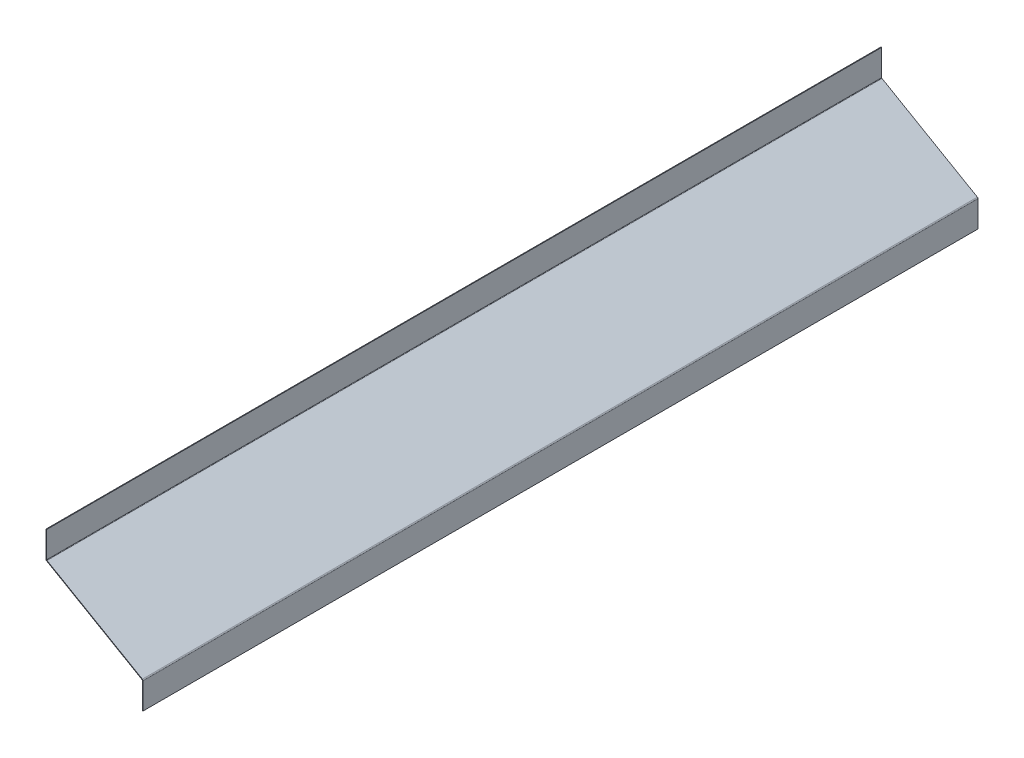
ISO-10303-21;
HEADER;
FILE_DESCRIPTION(('STEP AP214'),'2;1');
FILE_NAME('part.step','',(''),(''),'','','');
FILE_SCHEMA(('AUTOMOTIVE_DESIGN { 1 0 10303 214 1 1 1 1 }'));
ENDSEC;
DATA;
#1=APPLICATION_CONTEXT('core data for automotive mechanical design processes');
#2=APPLICATION_PROTOCOL_DEFINITION('international standard','automotive_design',2000,#1);
#3=PRODUCT_CONTEXT('',#1,'mechanical');
#4=PRODUCT('Part','Part','',(#3));
#5=PRODUCT_RELATED_PRODUCT_CATEGORY('part','',(#4));
#6=PRODUCT_DEFINITION_FORMATION('','',#4);
#7=PRODUCT_DEFINITION_CONTEXT('part definition',#1,'design');
#8=PRODUCT_DEFINITION('design','',#6,#7);
#9=PRODUCT_DEFINITION_SHAPE('','',#8);
#10=(LENGTH_UNIT() NAMED_UNIT(*) SI_UNIT(.MILLI.,.METRE.));
#11=(NAMED_UNIT(*) PLANE_ANGLE_UNIT() SI_UNIT($,.RADIAN.));
#12=(NAMED_UNIT(*) SI_UNIT($,.STERADIAN.) SOLID_ANGLE_UNIT());
#13=UNCERTAINTY_MEASURE_WITH_UNIT(LENGTH_MEASURE(1.E-05),#10,'distance_accuracy_value','');
#14=(GEOMETRIC_REPRESENTATION_CONTEXT(3) GLOBAL_UNCERTAINTY_ASSIGNED_CONTEXT((#13)) GLOBAL_UNIT_ASSIGNED_CONTEXT((#10,
#11,#12)) REPRESENTATION_CONTEXT('',''));
#15=CARTESIAN_POINT('',(0.,0.,0.));
#16=DIRECTION('',(0.,0.,1.));
#17=DIRECTION('',(1.,0.,0.));
#18=AXIS2_PLACEMENT_3D('',#15,#16,#17);
#19=CARTESIAN_POINT('',(0.500000000000002,-0.288675134594812,1242.));
#20=DIRECTION('',(0.,0.,1.));
#21=DIRECTION('',(1.,0.,0.));
#22=AXIS2_PLACEMENT_3D('',#19,#20,#21);
#23=PLANE('',#22);
#24=DIRECTION('',(-0.499999999999998,-0.86602540378444,0.));
#25=VECTOR('',#24,1.);
#26=CARTESIAN_POINT('',(0.500000000000002,-0.288675134594812,1242.));
#27=LINE('',#26,#25);
#28=CARTESIAN_POINT('',(0.500000000000002,-0.288675134594812,1242.));
#29=VERTEX_POINT('',#28);
#30=CARTESIAN_POINT('',(0.,-1.15470053837925,1242.));
#31=VERTEX_POINT('',#30);
#32=EDGE_CURVE('E11',#29,#31,#27,.T.);
#33=ORIENTED_EDGE('',*,*,#32,.F.);
#34=CARTESIAN_POINT('',(1.,0.577350269189627,1242.));
#35=DIRECTION('',(0.,0.,-1.));
#36=DIRECTION('',(-1.,0.,0.));
#37=AXIS2_PLACEMENT_3D('',#34,#35,#36);
#38=CIRCLE('',#37,1.);
#39=CARTESIAN_POINT('',(0.,0.577350269189626,1242.));
#40=VERTEX_POINT('',#39);
#41=EDGE_CURVE('E288',#40,#29,#38,.F.);
#42=ORIENTED_EDGE('',*,*,#41,.F.);
#43=DIRECTION('',(1.,0.,0.));
#44=VECTOR('',#43,1.);
#45=CARTESIAN_POINT('',(-1.,0.577350269189626,1242.));
#46=LINE('',#45,#44);
#47=CARTESIAN_POINT('',(-1.,0.577350269189626,1242.));
#48=VERTEX_POINT('',#47);
#49=EDGE_CURVE('E52',#48,#40,#46,.T.);
#50=ORIENTED_EDGE('',*,*,#49,.F.);
#51=CARTESIAN_POINT('',(1.,0.577350269189627,1242.));
#52=DIRECTION('',(0.,0.,1.));
#53=DIRECTION('',(1.,0.,0.));
#54=AXIS2_PLACEMENT_3D('',#51,#52,#53);
#55=CIRCLE('',#54,2.);
#56=EDGE_CURVE('E153',#48,#31,#55,.T.);
#57=ORIENTED_EDGE('',*,*,#56,.T.);
#58=EDGE_LOOP('',(#33,#42,#50,#57));
#59=FACE_BOUND('',#58,.T.);
#60=ADVANCED_FACE('F43',(#59),#23,.T.);
#61=CARTESIAN_POINT('',(-1.,0.577350269189626,1242.));
#62=DIRECTION('',(0.,0.,1.));
#63=DIRECTION('',(1.,0.,0.));
#64=AXIS2_PLACEMENT_3D('',#61,#62,#63);
#65=PLANE('',#64);
#66=DIRECTION('',(0.86602540378444,-0.499999999999998,0.));
#67=VECTOR('',#66,1.);
#68=CARTESIAN_POINT('',(0.,0.,1242.));
#69=LINE('',#68,#67);
#70=CARTESIAN_POINT('',(142.327204326325,-82.17264973081,1242.));
#71=VERTEX_POINT('',#70);
#72=EDGE_CURVE('E147',#29,#71,#69,.T.);
#73=ORIENTED_EDGE('',*,*,#72,.F.);
#74=ORIENTED_EDGE('',*,*,#32,.T.);
#75=DIRECTION('',(0.86602540378444,-0.499999999999998,0.));
#76=VECTOR('',#75,1.);
#77=CARTESIAN_POINT('',(-0.499999999999998,-0.86602540378444,1242.));
#78=LINE('',#77,#76);
#79=CARTESIAN_POINT('',(141.827204326325,-83.0386751345944,1242.));
#80=VERTEX_POINT('',#79);
#81=EDGE_CURVE('E144',#31,#80,#78,.T.);
#82=ORIENTED_EDGE('',*,*,#81,.T.);
#83=DIRECTION('',(0.499999999999998,0.866025403784439,0.));
#84=VECTOR('',#83,1.);
#85=CARTESIAN_POINT('',(141.827204326325,-83.0386751345944,1242.));
#86=LINE('',#85,#84);
#87=EDGE_CURVE('E264',#80,#71,#86,.T.);
#88=ORIENTED_EDGE('',*,*,#87,.T.);
#89=EDGE_LOOP('',(#73,#74,#82,#88));
#90=FACE_BOUND('',#89,.T.);
#91=ADVANCED_FACE('F142',(#90),#65,.T.);
#92=CARTESIAN_POINT('',(0.,0.577350269189626,0.));
#93=DIRECTION('',(0.,0.,-1.));
#94=DIRECTION('',(-1.,0.,0.));
#95=AXIS2_PLACEMENT_3D('',#92,#93,#94);
#96=PLANE('',#95);
#97=DIRECTION('',(-1.,0.,0.));
#98=VECTOR('',#97,1.);
#99=CARTESIAN_POINT('',(0.,0.577350269189626,0.));
#100=LINE('',#99,#98);
#101=CARTESIAN_POINT('',(0.,0.577350269189626,0.));
#102=VERTEX_POINT('',#101);
#103=CARTESIAN_POINT('',(-1.,0.577350269189626,0.));
#104=VERTEX_POINT('',#103);
#105=EDGE_CURVE('E272',#102,#104,#100,.T.);
#106=ORIENTED_EDGE('',*,*,#105,.F.);
#107=CARTESIAN_POINT('',(1.,0.577350269189627,0.));
#108=DIRECTION('',(0.,0.,-1.));
#109=DIRECTION('',(-1.,0.,0.));
#110=AXIS2_PLACEMENT_3D('',#107,#108,#109);
#111=CIRCLE('',#110,1.);
#112=CARTESIAN_POINT('',(0.500000000000002,-0.288675134594812,0.));
#113=VERTEX_POINT('',#112);
#114=EDGE_CURVE('E201',#102,#113,#111,.F.);
#115=ORIENTED_EDGE('',*,*,#114,.T.);
#116=DIRECTION('',(0.499999999999998,0.86602540378444,0.));
#117=VECTOR('',#116,1.);
#118=CARTESIAN_POINT('',(0.,-1.15470053837925,0.));
#119=LINE('',#118,#117);
#120=CARTESIAN_POINT('',(0.,-1.15470053837925,0.));
#121=VERTEX_POINT('',#120);
#122=EDGE_CURVE('E269',#121,#113,#119,.T.);
#123=ORIENTED_EDGE('',*,*,#122,.F.);
#124=CARTESIAN_POINT('',(1.,0.577350269189627,0.));
#125=DIRECTION('',(0.,0.,1.));
#126=DIRECTION('',(1.,0.,0.));
#127=AXIS2_PLACEMENT_3D('',#124,#125,#126);
#128=CIRCLE('',#127,2.);
#129=EDGE_CURVE('E166',#104,#121,#128,.T.);
#130=ORIENTED_EDGE('',*,*,#129,.F.);
#131=EDGE_LOOP('',(#106,#115,#123,#130));
#132=FACE_BOUND('',#131,.T.);
#133=ADVANCED_FACE('F335',(#132),#96,.T.);
#134=CARTESIAN_POINT('',(0.,-1.15470053837925,0.));
#135=DIRECTION('',(0.,0.,-1.));
#136=DIRECTION('',(-1.,0.,0.));
#137=AXIS2_PLACEMENT_3D('',#134,#135,#136);
#138=PLANE('',#137);
#139=DIRECTION('',(0.,-1.,0.));
#140=VECTOR('',#139,1.);
#141=CARTESIAN_POINT('',(0.,39.5,0.));
#142=LINE('',#141,#140);
#143=CARTESIAN_POINT('',(0.,39.5,0.));
#144=VERTEX_POINT('',#143);
#145=EDGE_CURVE('E205',#144,#102,#142,.T.);
#146=ORIENTED_EDGE('',*,*,#145,.T.);
#147=ORIENTED_EDGE('',*,*,#105,.T.);
#148=DIRECTION('',(0.,-1.,0.));
#149=VECTOR('',#148,1.);
#150=CARTESIAN_POINT('',(-1.,39.5,0.));
#151=LINE('',#150,#149);
#152=CARTESIAN_POINT('',(-1.,39.5,0.));
#153=VERTEX_POINT('',#152);
#154=EDGE_CURVE('E213',#153,#104,#151,.T.);
#155=ORIENTED_EDGE('',*,*,#154,.F.);
#156=DIRECTION('',(1.,0.,0.));
#157=VECTOR('',#156,1.);
#158=CARTESIAN_POINT('',(-1.,39.5,0.));
#159=LINE('',#158,#157);
#160=EDGE_CURVE('E209',#153,#144,#159,.T.);
#161=ORIENTED_EDGE('',*,*,#160,.T.);
#162=EDGE_LOOP('',(#146,#147,#155,#161));
#163=FACE_BOUND('',#162,.T.);
#164=ADVANCED_FACE('F338',(#163),#138,.T.);
#165=CARTESIAN_POINT('',(143.327204326325,-83.9047005383789,1242.));
#166=DIRECTION('',(0.,0.,1.));
#167=DIRECTION('',(1.,0.,0.));
#168=AXIS2_PLACEMENT_3D('',#165,#166,#167);
#169=PLANE('',#168);
#170=DIRECTION('',(-1.,0.,0.));
#171=VECTOR('',#170,1.);
#172=CARTESIAN_POINT('',(143.327204326325,-83.9047005383789,1242.));
#173=LINE('',#172,#171);
#174=CARTESIAN_POINT('',(143.327204326325,-83.9047005383789,1242.));
#175=VERTEX_POINT('',#174);
#176=CARTESIAN_POINT('',(142.327204326325,-83.9047005383789,1242.));
#177=VERTEX_POINT('',#176);
#178=EDGE_CURVE('E60',#175,#177,#173,.T.);
#179=ORIENTED_EDGE('',*,*,#178,.F.);
#180=CARTESIAN_POINT('',(141.327204326325,-83.9047005383789,1242.));
#181=DIRECTION('',(0.,0.,1.));
#182=DIRECTION('',(1.,0.,0.));
#183=AXIS2_PLACEMENT_3D('',#180,#181,#182);
#184=CIRCLE('',#183,2.);
#185=EDGE_CURVE('E303',#71,#175,#184,.F.);
#186=ORIENTED_EDGE('',*,*,#185,.F.);
#187=ORIENTED_EDGE('',*,*,#87,.F.);
#188=CARTESIAN_POINT('',(141.327204326325,-83.9047005383789,1242.));
#189=DIRECTION('',(0.,0.,1.));
#190=DIRECTION('',(1.,0.,0.));
#191=AXIS2_PLACEMENT_3D('',#188,#189,#190);
#192=CIRCLE('',#191,1.);
#193=EDGE_CURVE('E176',#80,#177,#192,.F.);
#194=ORIENTED_EDGE('',*,*,#193,.T.);
#195=EDGE_LOOP('',(#179,#186,#187,#194));
#196=FACE_BOUND('',#195,.T.);
#197=ADVANCED_FACE('F330',(#196),#169,.T.);
#198=CARTESIAN_POINT('',(141.827204326325,-83.0386751345944,1242.));
#199=DIRECTION('',(0.,0.,1.));
#200=DIRECTION('',(1.,0.,0.));
#201=AXIS2_PLACEMENT_3D('',#198,#199,#200);
#202=PLANE('',#201);
#203=DIRECTION('',(0.,-1.,0.));
#204=VECTOR('',#203,1.);
#205=CARTESIAN_POINT('',(143.327204326325,-82.7499999999996,1242.));
#206=LINE('',#205,#204);
#207=CARTESIAN_POINT('',(143.327204326325,-122.78,1242.));
#208=VERTEX_POINT('',#207);
#209=EDGE_CURVE('E307',#175,#208,#206,.T.);
#210=ORIENTED_EDGE('',*,*,#209,.F.);
#211=ORIENTED_EDGE('',*,*,#178,.T.);
#212=DIRECTION('',(0.,1.,0.));
#213=VECTOR('',#212,1.);
#214=CARTESIAN_POINT('',(142.327204326325,-82.7499999999996,1242.));
#215=LINE('',#214,#213);
#216=CARTESIAN_POINT('',(142.327204326325,-122.78,1242.));
#217=VERTEX_POINT('',#216);
#218=EDGE_CURVE('E114',#177,#217,#215,.F.);
#219=ORIENTED_EDGE('',*,*,#218,.T.);
#220=DIRECTION('',(-1.,0.,0.));
#221=VECTOR('',#220,1.);
#222=CARTESIAN_POINT('',(143.327204326325,-122.78,1242.));
#223=LINE('',#222,#221);
#224=EDGE_CURVE('E311',#208,#217,#223,.T.);
#225=ORIENTED_EDGE('',*,*,#224,.F.);
#226=EDGE_LOOP('',(#210,#211,#219,#225));
#227=FACE_BOUND('',#226,.T.);
#228=ADVANCED_FACE('F319',(#227),#202,.T.);
#229=CARTESIAN_POINT('',(142.327204326325,-82.17264973081,0.));
#230=DIRECTION('',(0.,0.,-1.));
#231=DIRECTION('',(-1.,0.,0.));
#232=AXIS2_PLACEMENT_3D('',#229,#230,#231);
#233=PLANE('',#232);
#234=DIRECTION('',(-0.499999999999998,-0.866025403784439,0.));
#235=VECTOR('',#234,1.);
#236=CARTESIAN_POINT('',(142.327204326325,-82.17264973081,0.));
#237=LINE('',#236,#235);
#238=CARTESIAN_POINT('',(142.327204326325,-82.17264973081,0.));
#239=VERTEX_POINT('',#238);
#240=CARTESIAN_POINT('',(141.827204326325,-83.0386751345944,0.));
#241=VERTEX_POINT('',#240);
#242=EDGE_CURVE('E101',#239,#241,#237,.T.);
#243=ORIENTED_EDGE('',*,*,#242,.F.);
#244=CARTESIAN_POINT('',(141.327204326325,-83.9047005383789,0.));
#245=DIRECTION('',(0.,0.,1.));
#246=DIRECTION('',(1.,0.,0.));
#247=AXIS2_PLACEMENT_3D('',#244,#245,#246);
#248=CIRCLE('',#247,2.);
#249=CARTESIAN_POINT('',(143.327204326325,-83.9047005383789,0.));
#250=VERTEX_POINT('',#249);
#251=EDGE_CURVE('E195',#239,#250,#248,.F.);
#252=ORIENTED_EDGE('',*,*,#251,.T.);
#253=DIRECTION('',(1.,0.,0.));
#254=VECTOR('',#253,1.);
#255=CARTESIAN_POINT('',(142.327204326325,-83.9047005383789,0.));
#256=LINE('',#255,#254);
#257=CARTESIAN_POINT('',(142.327204326325,-83.9047005383789,0.));
#258=VERTEX_POINT('',#257);
#259=EDGE_CURVE('E108',#258,#250,#256,.T.);
#260=ORIENTED_EDGE('',*,*,#259,.F.);
#261=CARTESIAN_POINT('',(141.327204326325,-83.9047005383789,0.));
#262=DIRECTION('',(0.,0.,1.));
#263=DIRECTION('',(1.,0.,0.));
#264=AXIS2_PLACEMENT_3D('',#261,#262,#263);
#265=CIRCLE('',#264,1.);
#266=EDGE_CURVE('E222',#241,#258,#265,.F.);
#267=ORIENTED_EDGE('',*,*,#266,.F.);
#268=EDGE_LOOP('',(#243,#252,#260,#267));
#269=FACE_BOUND('',#268,.T.);
#270=ADVANCED_FACE('F367',(#269),#233,.T.);
#271=CARTESIAN_POINT('',(142.327204326325,-83.9047005383789,0.));
#272=DIRECTION('',(0.,0.,-1.));
#273=DIRECTION('',(-1.,0.,0.));
#274=AXIS2_PLACEMENT_3D('',#271,#272,#273);
#275=PLANE('',#274);
#276=DIRECTION('',(0.86602540378444,-0.499999999999998,0.));
#277=VECTOR('',#276,1.);
#278=CARTESIAN_POINT('',(0.,0.,0.));
#279=LINE('',#278,#277);
#280=EDGE_CURVE('E198',#113,#239,#279,.T.);
#281=ORIENTED_EDGE('',*,*,#280,.T.);
#282=ORIENTED_EDGE('',*,*,#242,.T.);
#283=DIRECTION('',(0.86602540378444,-0.499999999999998,0.));
#284=VECTOR('',#283,1.);
#285=CARTESIAN_POINT('',(-0.499999999999998,-0.86602540378444,0.));
#286=LINE('',#285,#284);
#287=EDGE_CURVE('E219',#121,#241,#286,.T.);
#288=ORIENTED_EDGE('',*,*,#287,.F.);
#289=ORIENTED_EDGE('',*,*,#122,.T.);
#290=EDGE_LOOP('',(#281,#282,#288,#289));
#291=FACE_BOUND('',#290,.T.);
#292=ADVANCED_FACE('F370',(#291),#275,.T.);
#293=CARTESIAN_POINT('',(142.327204326325,-82.7499999999996,1242.));
#294=DIRECTION('',(1.,0.,0.));
#295=DIRECTION('',(0.,0.,-1.));
#296=AXIS2_PLACEMENT_3D('',#293,#294,#295);
#297=PLANE('',#296);
#298=DIRECTION('',(0.,1.,0.));
#299=VECTOR('',#298,1.);
#300=CARTESIAN_POINT('',(142.327204326325,-82.7499999999996,0.));
#301=LINE('',#300,#299);
#302=CARTESIAN_POINT('',(142.327204326325,-122.78,0.));
#303=VERTEX_POINT('',#302);
#304=EDGE_CURVE('E183',#258,#303,#301,.F.);
#305=ORIENTED_EDGE('',*,*,#304,.T.);
#306=DIRECTION('',(0.,0.,-1.));
#307=VECTOR('',#306,1.);
#308=CARTESIAN_POINT('',(142.327204326325,-122.78,1242.));
#309=LINE('',#308,#307);
#310=EDGE_CURVE('E257',#217,#303,#309,.T.);
#311=ORIENTED_EDGE('',*,*,#310,.F.);
#312=ORIENTED_EDGE('',*,*,#218,.F.);
#313=DIRECTION('',(0.,0.,-1.));
#314=VECTOR('',#313,1.);
#315=CARTESIAN_POINT('',(142.327204326325,-83.9047005383789,1242.));
#316=LINE('',#315,#314);
#317=EDGE_CURVE('E179',#177,#258,#316,.T.);
#318=ORIENTED_EDGE('',*,*,#317,.T.);
#319=EDGE_LOOP('',(#305,#311,#312,#318));
#320=FACE_BOUND('',#319,.T.);
#321=ADVANCED_FACE('F373',(#320),#297,.F.);
#322=CARTESIAN_POINT('',(143.327204326325,-122.78,1242.));
#323=DIRECTION('',(0.,-1.,0.));
#324=DIRECTION('',(0.,0.,-1.));
#325=AXIS2_PLACEMENT_3D('',#322,#323,#324);
#326=PLANE('',#325);
#327=DIRECTION('',(-1.,0.,0.));
#328=VECTOR('',#327,1.);
#329=CARTESIAN_POINT('',(143.327204326325,-122.78,0.));
#330=LINE('',#329,#328);
#331=CARTESIAN_POINT('',(143.327204326325,-122.78,0.));
#332=VERTEX_POINT('',#331);
#333=EDGE_CURVE('E187',#332,#303,#330,.T.);
#334=ORIENTED_EDGE('',*,*,#333,.F.);
#335=DIRECTION('',(0.,0.,-1.));
#336=VECTOR('',#335,1.);
#337=CARTESIAN_POINT('',(143.327204326325,-122.78,1242.));
#338=LINE('',#337,#336);
#339=EDGE_CURVE('E254',#208,#332,#338,.T.);
#340=ORIENTED_EDGE('',*,*,#339,.F.);
#341=ORIENTED_EDGE('',*,*,#224,.T.);
#342=ORIENTED_EDGE('',*,*,#310,.T.);
#343=EDGE_LOOP('',(#334,#340,#341,#342));
#344=FACE_BOUND('',#343,.T.);
#345=ADVANCED_FACE('F318',(#344),#326,.T.);
#346=CARTESIAN_POINT('',(143.327204326325,-82.7499999999996,1242.));
#347=DIRECTION('',(1.,0.,0.));
#348=DIRECTION('',(0.,0.,-1.));
#349=AXIS2_PLACEMENT_3D('',#346,#347,#348);
#350=PLANE('',#349);
#351=DIRECTION('',(0.,-1.,0.));
#352=VECTOR('',#351,1.);
#353=CARTESIAN_POINT('',(143.327204326325,-82.7499999999996,0.));
#354=LINE('',#353,#352);
#355=EDGE_CURVE('E191',#250,#332,#354,.T.);
#356=ORIENTED_EDGE('',*,*,#355,.F.);
#357=DIRECTION('',(0.,0.,-1.));
#358=VECTOR('',#357,1.);
#359=CARTESIAN_POINT('',(143.327204326325,-83.9047005383789,1242.));
#360=LINE('',#359,#358);
#361=EDGE_CURVE('E250',#175,#250,#360,.T.);
#362=ORIENTED_EDGE('',*,*,#361,.F.);
#363=ORIENTED_EDGE('',*,*,#209,.T.);
#364=ORIENTED_EDGE('',*,*,#339,.T.);
#365=EDGE_LOOP('',(#356,#362,#363,#364));
#366=FACE_BOUND('',#365,.T.);
#367=ADVANCED_FACE('F323',(#366),#350,.T.);
#368=CARTESIAN_POINT('',(141.327204326325,-83.9047005383789,1242.));
#369=DIRECTION('',(0.,0.,-1.));
#370=DIRECTION('',(-1.,0.,0.));
#371=AXIS2_PLACEMENT_3D('',#368,#369,#370);
#372=CYLINDRICAL_SURFACE('',#371,2.);
#373=ORIENTED_EDGE('',*,*,#251,.F.);
#374=DIRECTION('',(0.,0.,-1.));
#375=VECTOR('',#374,1.);
#376=CARTESIAN_POINT('',(142.327204326325,-82.17264973081,1242.));
#377=LINE('',#376,#375);
#378=EDGE_CURVE('E246',#71,#239,#377,.T.);
#379=ORIENTED_EDGE('',*,*,#378,.F.);
#380=ORIENTED_EDGE('',*,*,#185,.T.);
#381=ORIENTED_EDGE('',*,*,#361,.T.);
#382=EDGE_LOOP('',(#373,#379,#380,#381));
#383=FACE_BOUND('',#382,.T.);
#384=ADVANCED_FACE('F326',(#383),#372,.T.);
#385=CARTESIAN_POINT('',(0.,0.,1242.));
#386=DIRECTION('',(0.499999999999998,0.86602540378444,0.));
#387=DIRECTION('',(-0.86602540378444,0.499999999999998,0.));
#388=AXIS2_PLACEMENT_3D('',#385,#386,#387);
#389=PLANE('',#388);
#390=ORIENTED_EDGE('',*,*,#280,.F.);
#391=DIRECTION('',(0.,0.,-1.));
#392=VECTOR('',#391,1.);
#393=CARTESIAN_POINT('',(0.500000000000002,-0.288675134594812,1242.));
#394=LINE('',#393,#392);
#395=EDGE_CURVE('E242',#29,#113,#394,.T.);
#396=ORIENTED_EDGE('',*,*,#395,.F.);
#397=ORIENTED_EDGE('',*,*,#72,.T.);
#398=ORIENTED_EDGE('',*,*,#378,.T.);
#399=EDGE_LOOP('',(#390,#396,#397,#398));
#400=FACE_BOUND('',#399,.T.);
#401=ADVANCED_FACE('F333',(#400),#389,.T.);
#402=CARTESIAN_POINT('',(1.,0.577350269189627,1242.));
#403=DIRECTION('',(0.,0.,-1.));
#404=DIRECTION('',(-1.,0.,0.));
#405=AXIS2_PLACEMENT_3D('',#402,#403,#404);
#406=CYLINDRICAL_SURFACE('',#405,1.);
#407=ORIENTED_EDGE('',*,*,#114,.F.);
#408=DIRECTION('',(0.,0.,-1.));
#409=VECTOR('',#408,1.);
#410=CARTESIAN_POINT('',(0.,0.577350269189626,1242.));
#411=LINE('',#410,#409);
#412=EDGE_CURVE('E238',#40,#102,#411,.T.);
#413=ORIENTED_EDGE('',*,*,#412,.F.);
#414=ORIENTED_EDGE('',*,*,#41,.T.);
#415=ORIENTED_EDGE('',*,*,#395,.T.);
#416=EDGE_LOOP('',(#407,#413,#414,#415));
#417=FACE_BOUND('',#416,.T.);
#418=ADVANCED_FACE('F287',(#417),#406,.F.);
#419=CARTESIAN_POINT('',(0.,39.5,1242.));
#420=DIRECTION('',(1.,0.,0.));
#421=DIRECTION('',(0.,1.,0.));
#422=AXIS2_PLACEMENT_3D('',#419,#420,#421);
#423=PLANE('',#422);
#424=ORIENTED_EDGE('',*,*,#145,.F.);
#425=DIRECTION('',(0.,0.,-1.));
#426=VECTOR('',#425,1.);
#427=CARTESIAN_POINT('',(0.,39.5,1242.));
#428=LINE('',#427,#426);
#429=CARTESIAN_POINT('',(0.,39.5,1242.));
#430=VERTEX_POINT('',#429);
#431=EDGE_CURVE('E235',#430,#144,#428,.T.);
#432=ORIENTED_EDGE('',*,*,#431,.F.);
#433=DIRECTION('',(0.,-1.,0.));
#434=VECTOR('',#433,1.);
#435=CARTESIAN_POINT('',(0.,39.5,1242.));
#436=LINE('',#435,#434);
#437=EDGE_CURVE('E281',#430,#40,#436,.T.);
#438=ORIENTED_EDGE('',*,*,#437,.T.);
#439=ORIENTED_EDGE('',*,*,#412,.T.);
#440=EDGE_LOOP('',(#424,#432,#438,#439));
#441=FACE_BOUND('',#440,.T.);
#442=ADVANCED_FACE('F293',(#441),#423,.T.);
#443=CARTESIAN_POINT('',(-1.,39.5,1242.));
#444=DIRECTION('',(0.,1.,0.));
#445=DIRECTION('',(0.,0.,1.));
#446=AXIS2_PLACEMENT_3D('',#443,#444,#445);
#447=PLANE('',#446);
#448=ORIENTED_EDGE('',*,*,#160,.F.);
#449=DIRECTION('',(0.,0.,-1.));
#450=VECTOR('',#449,1.);
#451=CARTESIAN_POINT('',(-1.,39.5,1242.));
#452=LINE('',#451,#450);
#453=CARTESIAN_POINT('',(-1.,39.5,1242.));
#454=VERTEX_POINT('',#453);
#455=EDGE_CURVE('E232',#454,#153,#452,.T.);
#456=ORIENTED_EDGE('',*,*,#455,.F.);
#457=DIRECTION('',(1.,0.,0.));
#458=VECTOR('',#457,1.);
#459=CARTESIAN_POINT('',(-1.,39.5,1242.));
#460=LINE('',#459,#458);
#461=EDGE_CURVE('E295',#454,#430,#460,.T.);
#462=ORIENTED_EDGE('',*,*,#461,.T.);
#463=ORIENTED_EDGE('',*,*,#431,.T.);
#464=EDGE_LOOP('',(#448,#456,#462,#463));
#465=FACE_BOUND('',#464,.T.);
#466=ADVANCED_FACE('F343',(#465),#447,.T.);
#467=CARTESIAN_POINT('',(-1.,39.5,1242.));
#468=DIRECTION('',(1.,0.,0.));
#469=DIRECTION('',(0.,1.,0.));
#470=AXIS2_PLACEMENT_3D('',#467,#468,#469);
#471=PLANE('',#470);
#472=ORIENTED_EDGE('',*,*,#154,.T.);
#473=DIRECTION('',(0.,0.,-1.));
#474=VECTOR('',#473,1.);
#475=CARTESIAN_POINT('',(-1.,0.577350269189626,1242.));
#476=LINE('',#475,#474);
#477=EDGE_CURVE('E169',#48,#104,#476,.T.);
#478=ORIENTED_EDGE('',*,*,#477,.F.);
#479=DIRECTION('',(0.,-1.,0.));
#480=VECTOR('',#479,1.);
#481=CARTESIAN_POINT('',(-1.,39.5,1242.));
#482=LINE('',#481,#480);
#483=EDGE_CURVE('E159',#454,#48,#482,.T.);
#484=ORIENTED_EDGE('',*,*,#483,.F.);
#485=ORIENTED_EDGE('',*,*,#455,.T.);
#486=EDGE_LOOP('',(#472,#478,#484,#485));
#487=FACE_BOUND('',#486,.T.);
#488=ADVANCED_FACE('F341',(#487),#471,.F.);
#489=CARTESIAN_POINT('',(1.,0.577350269189627,1242.));
#490=DIRECTION('',(0.,0.,-1.));
#491=DIRECTION('',(-1.,0.,0.));
#492=AXIS2_PLACEMENT_3D('',#489,#490,#491);
#493=CYLINDRICAL_SURFACE('',#492,2.);
#494=ORIENTED_EDGE('',*,*,#129,.T.);
#495=DIRECTION('',(0.,0.,-1.));
#496=VECTOR('',#495,1.);
#497=CARTESIAN_POINT('',(0.,-1.15470053837925,1242.));
#498=LINE('',#497,#496);
#499=EDGE_CURVE('E163',#31,#121,#498,.T.);
#500=ORIENTED_EDGE('',*,*,#499,.F.);
#501=ORIENTED_EDGE('',*,*,#56,.F.);
#502=ORIENTED_EDGE('',*,*,#477,.T.);
#503=EDGE_LOOP('',(#494,#500,#501,#502));
#504=FACE_BOUND('',#503,.T.);
#505=ADVANCED_FACE('F164',(#504),#493,.T.);
#506=CARTESIAN_POINT('',(-0.499999999999998,-0.86602540378444,1242.));
#507=DIRECTION('',(0.499999999999998,0.86602540378444,0.));
#508=DIRECTION('',(-0.86602540378444,0.499999999999998,0.));
#509=AXIS2_PLACEMENT_3D('',#506,#507,#508);
#510=PLANE('',#509);
#511=ORIENTED_EDGE('',*,*,#287,.T.);
#512=DIRECTION('',(0.,0.,-1.));
#513=VECTOR('',#512,1.);
#514=CARTESIAN_POINT('',(141.827204326325,-83.0386751345944,1242.));
#515=LINE('',#514,#513);
#516=EDGE_CURVE('E170',#80,#241,#515,.T.);
#517=ORIENTED_EDGE('',*,*,#516,.F.);
#518=ORIENTED_EDGE('',*,*,#81,.F.);
#519=ORIENTED_EDGE('',*,*,#499,.T.);
#520=EDGE_LOOP('',(#511,#517,#518,#519));
#521=FACE_BOUND('',#520,.T.);
#522=ADVANCED_FACE('F172',(#521),#510,.F.);
#523=CARTESIAN_POINT('',(141.327204326325,-83.9047005383789,1242.));
#524=DIRECTION('',(0.,0.,-1.));
#525=DIRECTION('',(-1.,0.,0.));
#526=AXIS2_PLACEMENT_3D('',#523,#524,#525);
#527=CYLINDRICAL_SURFACE('',#526,1.);
#528=ORIENTED_EDGE('',*,*,#266,.T.);
#529=ORIENTED_EDGE('',*,*,#317,.F.);
#530=ORIENTED_EDGE('',*,*,#193,.F.);
#531=ORIENTED_EDGE('',*,*,#516,.T.);
#532=EDGE_LOOP('',(#528,#529,#530,#531));
#533=FACE_BOUND('',#532,.T.);
#534=ADVANCED_FACE('F426',(#533),#527,.F.);
#535=CARTESIAN_POINT('',(141.327204326325,-83.9047005383789,1242.));
#536=DIRECTION('',(0.,0.,1.));
#537=DIRECTION('',(1.,0.,0.));
#538=AXIS2_PLACEMENT_3D('',#535,#536,#537);
#539=PLANE('',#538);
#540=ORIENTED_EDGE('',*,*,#483,.T.);
#541=ORIENTED_EDGE('',*,*,#49,.T.);
#542=ORIENTED_EDGE('',*,*,#437,.F.);
#543=ORIENTED_EDGE('',*,*,#461,.F.);
#544=EDGE_LOOP('',(#540,#541,#542,#543));
#545=FACE_BOUND('',#544,.T.);
#546=ADVANCED_FACE('F278',(#545),#539,.T.);
#547=CARTESIAN_POINT('',(141.327204326325,-83.9047005383789,0.));
#548=DIRECTION('',(0.,0.,1.));
#549=DIRECTION('',(1.,0.,0.));
#550=AXIS2_PLACEMENT_3D('',#547,#548,#549);
#551=PLANE('',#550);
#552=ORIENTED_EDGE('',*,*,#304,.F.);
#553=ORIENTED_EDGE('',*,*,#259,.T.);
#554=ORIENTED_EDGE('',*,*,#355,.T.);
#555=ORIENTED_EDGE('',*,*,#333,.T.);
#556=EDGE_LOOP('',(#552,#553,#554,#555));
#557=FACE_BOUND('',#556,.T.);
#558=ADVANCED_FACE('F446',(#557),#551,.F.);
#559=CLOSED_SHELL('',(#60,#91,#133,#164,#197,#228,#270,#292,#321,#345,#367,#384,#401,#418,#442,
#466,#488,#505,#522,#534,#546,#558));
#560=MANIFOLD_SOLID_BREP('B2',#559);
#561=ADVANCED_BREP_SHAPE_REPRESENTATION('',(#18,#560),#14);
#562=SHAPE_DEFINITION_REPRESENTATION(#9,#561);
ENDSEC;
END-ISO-10303-21;
